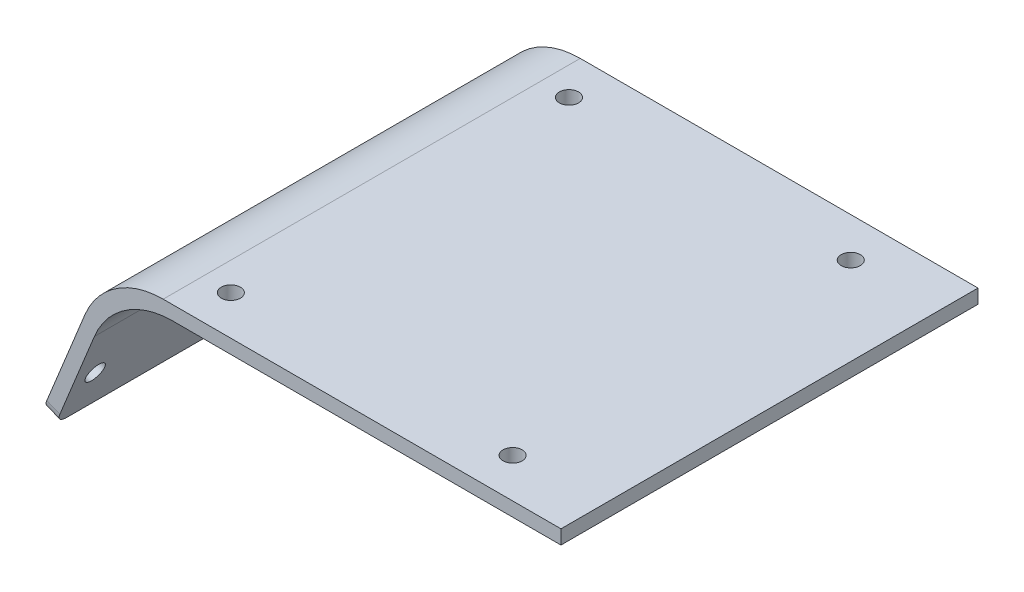
ISO-10303-21;
HEADER;
FILE_DESCRIPTION(('STEP AP214'),'2;1');
FILE_NAME('part.step','',(''),(''),'','','');
FILE_SCHEMA(('AUTOMOTIVE_DESIGN { 1 0 10303 214 1 1 1 1 }'));
ENDSEC;
DATA;
#1=APPLICATION_CONTEXT('core data for automotive mechanical design processes');
#2=APPLICATION_PROTOCOL_DEFINITION('international standard','automotive_design',2000,#1);
#3=PRODUCT_CONTEXT('',#1,'mechanical');
#4=PRODUCT('Part','Part','',(#3));
#5=PRODUCT_RELATED_PRODUCT_CATEGORY('part','',(#4));
#6=PRODUCT_DEFINITION_FORMATION('','',#4);
#7=PRODUCT_DEFINITION_CONTEXT('part definition',#1,'design');
#8=PRODUCT_DEFINITION('design','',#6,#7);
#9=PRODUCT_DEFINITION_SHAPE('','',#8);
#10=(LENGTH_UNIT() NAMED_UNIT(*) SI_UNIT(.MILLI.,.METRE.));
#11=(NAMED_UNIT(*) PLANE_ANGLE_UNIT() SI_UNIT($,.RADIAN.));
#12=(NAMED_UNIT(*) SI_UNIT($,.STERADIAN.) SOLID_ANGLE_UNIT());
#13=UNCERTAINTY_MEASURE_WITH_UNIT(LENGTH_MEASURE(1.E-05),#10,'distance_accuracy_value','');
#14=(GEOMETRIC_REPRESENTATION_CONTEXT(3) GLOBAL_UNCERTAINTY_ASSIGNED_CONTEXT((#13)) GLOBAL_UNIT_ASSIGNED_CONTEXT((#10,
#11,#12)) REPRESENTATION_CONTEXT('',''));
#15=CARTESIAN_POINT('',(0.,0.,0.));
#16=DIRECTION('',(0.,0.,1.));
#17=DIRECTION('',(1.,0.,0.));
#18=AXIS2_PLACEMENT_3D('',#15,#16,#17);
#19=CARTESIAN_POINT('',(-71.3303467015639,13.1067528996389,74.));
#20=DIRECTION('',(0.377678223385462,0.92593690907124,0.));
#21=DIRECTION('',(-0.92593690907124,0.377678223385462,0.));
#22=AXIS2_PLACEMENT_3D('',#19,#20,#21);
#23=PLANE('',#22);
#24=DIRECTION('',(0.,0.,-1.));
#25=VECTOR('',#24,1.);
#26=CARTESIAN_POINT('',(-71.3303467015639,13.1067528996389,74.));
#27=LINE('',#26,#25);
#28=CARTESIAN_POINT('',(-71.3303467015639,13.1067528996389,72.));
#29=VERTEX_POINT('',#28);
#30=CARTESIAN_POINT('',(-71.3303467015639,13.1067528996389,2.));
#31=VERTEX_POINT('',#30);
#32=EDGE_CURVE('E150',#29,#31,#27,.T.);
#33=ORIENTED_EDGE('',*,*,#32,.T.);
#34=DIRECTION('',(0.92593690907124,-0.377678223385462,0.));
#35=VECTOR('',#34,1.);
#36=CARTESIAN_POINT('',(-71.3303467015639,13.1067528996389,2.));
#37=LINE('',#36,#35);
#38=CARTESIAN_POINT('',(-69.0155044288857,12.1625573411753,2.));
#39=VERTEX_POINT('',#38);
#40=EDGE_CURVE('E187',#31,#39,#37,.T.);
#41=ORIENTED_EDGE('',*,*,#40,.T.);
#42=DIRECTION('',(0.,0.,-1.));
#43=VECTOR('',#42,1.);
#44=CARTESIAN_POINT('',(-69.0155044288857,12.1625573411753,74.));
#45=LINE('',#44,#43);
#46=CARTESIAN_POINT('',(-69.0155044288857,12.1625573411753,72.));
#47=VERTEX_POINT('',#46);
#48=EDGE_CURVE('E137',#47,#39,#45,.T.);
#49=ORIENTED_EDGE('',*,*,#48,.F.);
#50=DIRECTION('',(0.92593690907124,-0.377678223385462,0.));
#51=VECTOR('',#50,1.);
#52=CARTESIAN_POINT('',(-71.3303467015639,13.1067528996389,72.));
#53=LINE('',#52,#51);
#54=EDGE_CURVE('E185',#47,#29,#53,.F.);
#55=ORIENTED_EDGE('',*,*,#54,.T.);
#56=EDGE_LOOP('',(#33,#41,#49,#55));
#57=FACE_BOUND('',#56,.T.);
#58=ADVANCED_FACE('F34',(#57),#23,.F.);
#59=CARTESIAN_POINT('',(-69.0155044288857,12.1625573411753,74.));
#60=DIRECTION('',(-0.92593690907124,0.377678223385462,0.));
#61=DIRECTION('',(-0.377678223385462,-0.92593690907124,0.));
#62=AXIS2_PLACEMENT_3D('',#59,#60,#61);
#63=PLANE('',#62);
#64=CARTESIAN_POINT('',(-65.994078641802,19.5700526137452,4.));
#65=DIRECTION('',(-0.92593690907124,0.377678223385462,0.));
#66=DIRECTION('',(-0.377678223385462,-0.92593690907124,0.));
#67=AXIS2_PLACEMENT_3D('',#64,#65,#66);
#68=CIRCLE('',#67,1.7);
#69=CARTESIAN_POINT('',(-66.6361316215573,17.9959598683241,4.));
#70=VERTEX_POINT('',#69);
#71=EDGE_CURVE('E212',#70,#70,#68,.T.);
#72=ORIENTED_EDGE('',*,*,#71,.T.);
#73=EDGE_LOOP('',(#72));
#74=FACE_BOUND('',#73,.T.);
#75=CARTESIAN_POINT('',(-65.994078641802,19.5700526137452,70.));
#76=DIRECTION('',(-0.92593690907124,0.377678223385462,0.));
#77=DIRECTION('',(-0.377678223385462,-0.92593690907124,0.));
#78=AXIS2_PLACEMENT_3D('',#75,#76,#77);
#79=CIRCLE('',#78,1.7);
#80=CARTESIAN_POINT('',(-66.6361316215573,17.9959598683241,70.));
#81=VERTEX_POINT('',#80);
#82=EDGE_CURVE('E202',#81,#81,#79,.T.);
#83=ORIENTED_EDGE('',*,*,#82,.T.);
#84=EDGE_LOOP('',(#83));
#85=FACE_BOUND('',#84,.T.);
#86=CARTESIAN_POINT('',(-65.994078641802,19.5700526137452,35.));
#87=DIRECTION('',(-0.92593690907124,0.377678223385462,0.));
#88=DIRECTION('',(-0.377678223385462,-0.92593690907124,0.));
#89=AXIS2_PLACEMENT_3D('',#86,#87,#88);
#90=CIRCLE('',#89,1.7);
#91=CARTESIAN_POINT('',(-66.6361316215573,17.9959598683241,35.));
#92=VERTEX_POINT('',#91);
#93=EDGE_CURVE('E199',#92,#92,#90,.T.);
#94=ORIENTED_EDGE('',*,*,#93,.T.);
#95=EDGE_LOOP('',(#94));
#96=FACE_BOUND('',#95,.T.);
#97=ORIENTED_EDGE('',*,*,#48,.T.);
#98=CARTESIAN_POINT('',(-68.2601479821148,14.0144311593177,2.));
#99=DIRECTION('',(-0.92593690907124,0.377678223385462,0.));
#100=DIRECTION('',(-0.377678223385462,-0.92593690907124,0.));
#101=AXIS2_PLACEMENT_3D('',#98,#99,#100);
#102=CIRCLE('',#101,2.);
#103=CARTESIAN_POINT('',(-68.2601479821148,14.0144311593177,0.));
#104=VERTEX_POINT('',#103);
#105=EDGE_CURVE('E192',#39,#104,#102,.F.);
#106=ORIENTED_EDGE('',*,*,#105,.T.);
#107=DIRECTION('',(0.377678223385462,0.92593690907124,0.));
#108=VECTOR('',#107,1.);
#109=CARTESIAN_POINT('',(-69.0155044288857,12.1625573411753,0.));
#110=LINE('',#109,#108);
#111=CARTESIAN_POINT('',(-62.1273115734498,29.050033522558,0.));
#112=VERTEX_POINT('',#111);
#113=EDGE_CURVE('E151',#104,#112,#110,.T.);
#114=ORIENTED_EDGE('',*,*,#113,.T.);
#115=DIRECTION('',(0.,0.,-1.));
#116=VECTOR('',#115,1.);
#117=CARTESIAN_POINT('',(-62.1273115734498,29.050033522558,74.));
#118=LINE('',#117,#116);
#119=CARTESIAN_POINT('',(-62.1273115734498,29.050033522558,74.));
#120=VERTEX_POINT('',#119);
#121=EDGE_CURVE('E169',#112,#120,#118,.F.);
#122=ORIENTED_EDGE('',*,*,#121,.T.);
#123=DIRECTION('',(0.377678223385462,0.92593690907124,0.));
#124=VECTOR('',#123,1.);
#125=CARTESIAN_POINT('',(-69.0155044288857,12.1625573411753,74.));
#126=LINE('',#125,#124);
#127=CARTESIAN_POINT('',(-68.2601479821148,14.0144311593177,74.));
#128=VERTEX_POINT('',#127);
#129=EDGE_CURVE('E128',#128,#120,#126,.T.);
#130=ORIENTED_EDGE('',*,*,#129,.F.);
#131=CARTESIAN_POINT('',(-68.2601479821148,14.0144311593177,72.));
#132=DIRECTION('',(-0.92593690907124,0.377678223385462,0.));
#133=DIRECTION('',(-0.377678223385462,-0.92593690907124,0.));
#134=AXIS2_PLACEMENT_3D('',#131,#132,#133);
#135=CIRCLE('',#134,2.);
#136=EDGE_CURVE('E190',#128,#47,#135,.F.);
#137=ORIENTED_EDGE('',*,*,#136,.T.);
#138=EDGE_LOOP('',(#97,#106,#114,#122,#130,#137));
#139=FACE_BOUND('',#138,.T.);
#140=ADVANCED_FACE('F241',(#74,#85,#96,#139),#63,.F.);
#141=CARTESIAN_POINT('',(-58.3197511339116,38.3848601717761,74.));
#142=DIRECTION('',(0.,1.,0.));
#143=DIRECTION('',(-1.,0.,0.));
#144=AXIS2_PLACEMENT_3D('',#141,#142,#143);
#145=PLANE('',#144);
#146=CARTESIAN_POINT('',(-44.9185068034696,38.3848601717761,67.));
#147=DIRECTION('',(0.,1.,0.));
#148=DIRECTION('',(-1.,0.,0.));
#149=AXIS2_PLACEMENT_3D('',#146,#147,#148);
#150=CIRCLE('',#149,1.70000000000001);
#151=CARTESIAN_POINT('',(-46.6185068034696,38.3848601717761,67.));
#152=VERTEX_POINT('',#151);
#153=EDGE_CURVE('E153',#152,#152,#150,.T.);
#154=ORIENTED_EDGE('',*,*,#153,.T.);
#155=EDGE_LOOP('',(#154));
#156=FACE_BOUND('',#155,.T.);
#157=CARTESIAN_POINT('',(5.08149319653038,38.3848601717761,6.99999999999993));
#158=DIRECTION('',(0.,1.,0.));
#159=DIRECTION('',(-1.,0.,0.));
#160=AXIS2_PLACEMENT_3D('',#157,#158,#159);
#161=CIRCLE('',#160,1.7);
#162=CARTESIAN_POINT('',(3.38149319653038,38.3848601717761,6.99999999999993));
#163=VERTEX_POINT('',#162);
#164=EDGE_CURVE('E233',#163,#163,#161,.T.);
#165=ORIENTED_EDGE('',*,*,#164,.T.);
#166=EDGE_LOOP('',(#165));
#167=FACE_BOUND('',#166,.T.);
#168=CARTESIAN_POINT('',(-44.9185068034696,38.3848601717761,6.99999999999993));
#169=DIRECTION('',(0.,1.,0.));
#170=DIRECTION('',(-1.,0.,0.));
#171=AXIS2_PLACEMENT_3D('',#168,#169,#170);
#172=CIRCLE('',#171,1.69999999999999);
#173=CARTESIAN_POINT('',(-46.6185068034696,38.3848601717761,6.99999999999993));
#174=VERTEX_POINT('',#173);
#175=EDGE_CURVE('E230',#174,#174,#172,.T.);
#176=ORIENTED_EDGE('',*,*,#175,.T.);
#177=EDGE_LOOP('',(#176));
#178=FACE_BOUND('',#177,.T.);
#179=CARTESIAN_POINT('',(5.08149319653038,38.3848601717761,66.9999999999999));
#180=DIRECTION('',(0.,1.,0.));
#181=DIRECTION('',(-1.,0.,0.));
#182=AXIS2_PLACEMENT_3D('',#179,#180,#181);
#183=CIRCLE('',#182,1.70000000000001);
#184=CARTESIAN_POINT('',(3.38149319653037,38.3848601717761,66.9999999999999));
#185=VERTEX_POINT('',#184);
#186=EDGE_CURVE('E227',#185,#185,#183,.T.);
#187=ORIENTED_EDGE('',*,*,#186,.T.);
#188=EDGE_LOOP('',(#187));
#189=FACE_BOUND('',#188,.T.);
#190=DIRECTION('',(1.,0.,0.));
#191=VECTOR('',#190,1.);
#192=CARTESIAN_POINT('',(-58.3197511339116,38.3848601717761,74.));
#193=LINE('',#192,#191);
#194=CARTESIAN_POINT('',(-48.2382579373812,38.3848601717761,74.));
#195=VERTEX_POINT('',#194);
#196=CARTESIAN_POINT('',(20.66,38.3848601717761,74.));
#197=VERTEX_POINT('',#196);
#198=EDGE_CURVE('E116',#195,#197,#193,.T.);
#199=ORIENTED_EDGE('',*,*,#198,.F.);
#200=DIRECTION('',(0.,0.,-1.));
#201=VECTOR('',#200,1.);
#202=CARTESIAN_POINT('',(-48.2382579373812,38.3848601717761,0.));
#203=LINE('',#202,#201);
#204=CARTESIAN_POINT('',(-48.2382579373812,38.3848601717761,0.));
#205=VERTEX_POINT('',#204);
#206=EDGE_CURVE('E167',#195,#205,#203,.T.);
#207=ORIENTED_EDGE('',*,*,#206,.T.);
#208=DIRECTION('',(1.,0.,0.));
#209=VECTOR('',#208,1.);
#210=CARTESIAN_POINT('',(-58.3197511339116,38.3848601717761,0.));
#211=LINE('',#210,#209);
#212=CARTESIAN_POINT('',(20.66,38.3848601717761,0.));
#213=VERTEX_POINT('',#212);
#214=EDGE_CURVE('E134',#205,#213,#211,.T.);
#215=ORIENTED_EDGE('',*,*,#214,.T.);
#216=DIRECTION('',(0.,0.,-1.));
#217=VECTOR('',#216,1.);
#218=CARTESIAN_POINT('',(20.66,38.3848601717761,74.));
#219=LINE('',#218,#217);
#220=EDGE_CURVE('E131',#197,#213,#219,.T.);
#221=ORIENTED_EDGE('',*,*,#220,.F.);
#222=EDGE_LOOP('',(#199,#207,#215,#221));
#223=FACE_BOUND('',#222,.T.);
#224=ADVANCED_FACE('F132',(#156,#167,#178,#189,#223),#145,.F.);
#225=CARTESIAN_POINT('',(20.66,38.3848601717761,74.));
#226=DIRECTION('',(-1.,0.,0.));
#227=DIRECTION('',(0.,-1.,0.));
#228=AXIS2_PLACEMENT_3D('',#225,#226,#227);
#229=PLANE('',#228);
#230=DIRECTION('',(0.,1.,0.));
#231=VECTOR('',#230,1.);
#232=CARTESIAN_POINT('',(20.66,38.3848601717761,0.));
#233=LINE('',#232,#231);
#234=CARTESIAN_POINT('',(20.66,40.8848601717761,0.));
#235=VERTEX_POINT('',#234);
#236=EDGE_CURVE('E155',#213,#235,#233,.T.);
#237=ORIENTED_EDGE('',*,*,#236,.T.);
#238=DIRECTION('',(0.,0.,-1.));
#239=VECTOR('',#238,1.);
#240=CARTESIAN_POINT('',(20.66,40.8848601717761,74.));
#241=LINE('',#240,#239);
#242=CARTESIAN_POINT('',(20.66,40.8848601717761,74.));
#243=VERTEX_POINT('',#242);
#244=EDGE_CURVE('E138',#243,#235,#241,.T.);
#245=ORIENTED_EDGE('',*,*,#244,.F.);
#246=DIRECTION('',(0.,1.,0.));
#247=VECTOR('',#246,1.);
#248=CARTESIAN_POINT('',(20.66,38.3848601717761,74.));
#249=LINE('',#248,#247);
#250=EDGE_CURVE('E121',#197,#243,#249,.T.);
#251=ORIENTED_EDGE('',*,*,#250,.F.);
#252=ORIENTED_EDGE('',*,*,#220,.T.);
#253=EDGE_LOOP('',(#237,#245,#251,#252));
#254=FACE_BOUND('',#253,.T.);
#255=ADVANCED_FACE('F140',(#254),#229,.F.);
#256=CARTESIAN_POINT('',(-60.,40.8848601717761,74.));
#257=DIRECTION('',(0.,-1.,0.));
#258=DIRECTION('',(1.,0.,0.));
#259=AXIS2_PLACEMENT_3D('',#256,#257,#258);
#260=PLANE('',#259);
#261=CARTESIAN_POINT('',(-44.9185068034696,40.8848601717761,67.));
#262=DIRECTION('',(0.,1.,0.));
#263=DIRECTION('',(0.,0.,1.));
#264=AXIS2_PLACEMENT_3D('',#261,#262,#263);
#265=CIRCLE('',#264,1.70000000000001);
#266=CARTESIAN_POINT('',(-44.9185068034696,40.8848601717761,68.7));
#267=VERTEX_POINT('',#266);
#268=EDGE_CURVE('E219',#267,#267,#265,.T.);
#269=ORIENTED_EDGE('',*,*,#268,.F.);
#270=EDGE_LOOP('',(#269));
#271=FACE_BOUND('',#270,.T.);
#272=CARTESIAN_POINT('',(5.08149319653038,40.8848601717761,6.99999999999993));
#273=DIRECTION('',(0.,1.,0.));
#274=DIRECTION('',(0.,0.,1.));
#275=AXIS2_PLACEMENT_3D('',#272,#273,#274);
#276=CIRCLE('',#275,1.7);
#277=CARTESIAN_POINT('',(5.08149319653038,40.8848601717761,8.69999999999992));
#278=VERTEX_POINT('',#277);
#279=EDGE_CURVE('E218',#278,#278,#276,.T.);
#280=ORIENTED_EDGE('',*,*,#279,.F.);
#281=EDGE_LOOP('',(#280));
#282=FACE_BOUND('',#281,.T.);
#283=CARTESIAN_POINT('',(-44.9185068034696,40.8848601717761,6.99999999999993));
#284=DIRECTION('',(0.,1.,0.));
#285=DIRECTION('',(0.,0.,1.));
#286=AXIS2_PLACEMENT_3D('',#283,#284,#285);
#287=CIRCLE('',#286,1.69999999999999);
#288=CARTESIAN_POINT('',(-44.9185068034696,40.8848601717761,8.69999999999992));
#289=VERTEX_POINT('',#288);
#290=EDGE_CURVE('E215',#289,#289,#287,.T.);
#291=ORIENTED_EDGE('',*,*,#290,.F.);
#292=EDGE_LOOP('',(#291));
#293=FACE_BOUND('',#292,.T.);
#294=CARTESIAN_POINT('',(5.08149319653038,40.8848601717761,66.9999999999999));
#295=DIRECTION('',(0.,1.,0.));
#296=DIRECTION('',(0.,0.,1.));
#297=AXIS2_PLACEMENT_3D('',#294,#295,#296);
#298=CIRCLE('',#297,1.70000000000001);
#299=CARTESIAN_POINT('',(5.08149319653038,40.8848601717761,68.6999999999999));
#300=VERTEX_POINT('',#299);
#301=EDGE_CURVE('E222',#300,#300,#298,.T.);
#302=ORIENTED_EDGE('',*,*,#301,.F.);
#303=EDGE_LOOP('',(#302));
#304=FACE_BOUND('',#303,.T.);
#305=DIRECTION('',(-1.,0.,0.));
#306=VECTOR('',#305,1.);
#307=CARTESIAN_POINT('',(-60.,40.8848601717761,0.));
#308=LINE('',#307,#306);
#309=CARTESIAN_POINT('',(-49.9185068034696,40.8848601717761,0.));
#310=VERTEX_POINT('',#309);
#311=EDGE_CURVE('E157',#235,#310,#308,.T.);
#312=ORIENTED_EDGE('',*,*,#311,.T.);
#313=DIRECTION('',(0.,0.,-1.));
#314=VECTOR('',#313,1.);
#315=CARTESIAN_POINT('',(-49.9185068034696,40.8848601717761,74.));
#316=LINE('',#315,#314);
#317=CARTESIAN_POINT('',(-49.9185068034696,40.8848601717761,74.));
#318=VERTEX_POINT('',#317);
#319=EDGE_CURVE('E175',#310,#318,#316,.F.);
#320=ORIENTED_EDGE('',*,*,#319,.T.);
#321=DIRECTION('',(-1.,0.,0.));
#322=VECTOR('',#321,1.);
#323=CARTESIAN_POINT('',(-60.,40.8848601717761,74.));
#324=LINE('',#323,#322);
#325=EDGE_CURVE('E143',#243,#318,#324,.T.);
#326=ORIENTED_EDGE('',*,*,#325,.F.);
#327=ORIENTED_EDGE('',*,*,#244,.T.);
#328=EDGE_LOOP('',(#312,#320,#326,#327));
#329=FACE_BOUND('',#328,.T.);
#330=ADVANCED_FACE('F247',(#271,#282,#293,#304,#329),#260,.F.);
#331=CARTESIAN_POINT('',(-71.3303467015639,13.1067528996389,74.));
#332=DIRECTION('',(0.92593690907124,-0.377678223385462,0.));
#333=DIRECTION('',(0.377678223385462,0.92593690907124,0.));
#334=AXIS2_PLACEMENT_3D('',#331,#332,#333);
#335=PLANE('',#334);
#336=CARTESIAN_POINT('',(-68.3089209144802,20.5142481722088,4.));
#337=DIRECTION('',(0.92593690907124,-0.377678223385462,0.));
#338=DIRECTION('',(0.377678223385462,0.92593690907124,0.));
#339=AXIS2_PLACEMENT_3D('',#336,#337,#338);
#340=CIRCLE('',#339,1.7);
#341=CARTESIAN_POINT('',(-67.6668679347249,22.0883409176299,4.));
#342=VERTEX_POINT('',#341);
#343=EDGE_CURVE('E38',#342,#342,#340,.T.);
#344=ORIENTED_EDGE('',*,*,#343,.T.);
#345=EDGE_LOOP('',(#344));
#346=FACE_BOUND('',#345,.T.);
#347=CARTESIAN_POINT('',(-68.3089209144802,20.5142481722088,70.));
#348=DIRECTION('',(0.92593690907124,-0.377678223385462,0.));
#349=DIRECTION('',(0.377678223385462,0.92593690907124,0.));
#350=AXIS2_PLACEMENT_3D('',#347,#348,#349);
#351=CIRCLE('',#350,1.7);
#352=CARTESIAN_POINT('',(-67.6668679347249,22.0883409176299,70.));
#353=VERTEX_POINT('',#352);
#354=EDGE_CURVE('E200',#353,#353,#351,.T.);
#355=ORIENTED_EDGE('',*,*,#354,.T.);
#356=EDGE_LOOP('',(#355));
#357=FACE_BOUND('',#356,.T.);
#358=CARTESIAN_POINT('',(-68.3089209144802,20.5142481722089,35.));
#359=DIRECTION('',(0.92593690907124,-0.377678223385462,0.));
#360=DIRECTION('',(0.377678223385462,0.92593690907124,0.));
#361=AXIS2_PLACEMENT_3D('',#358,#359,#360);
#362=CIRCLE('',#361,1.7);
#363=CARTESIAN_POINT('',(-67.6668679347249,22.08834091763,35.));
#364=VERTEX_POINT('',#363);
#365=EDGE_CURVE('E197',#364,#364,#362,.T.);
#366=ORIENTED_EDGE('',*,*,#365,.T.);
#367=EDGE_LOOP('',(#366));
#368=FACE_BOUND('',#367,.T.);
#369=DIRECTION('',(-0.377678223385462,-0.92593690907124,0.));
#370=VECTOR('',#369,1.);
#371=CARTESIAN_POINT('',(-71.3303467015639,13.1067528996389,0.));
#372=LINE('',#371,#370);
#373=CARTESIAN_POINT('',(-63.8075604395382,31.550033522558,0.));
#374=VERTEX_POINT('',#373);
#375=CARTESIAN_POINT('',(-70.5749902547929,14.9586267177814,0.));
#376=VERTEX_POINT('',#375);
#377=EDGE_CURVE('E160',#374,#376,#372,.T.);
#378=ORIENTED_EDGE('',*,*,#377,.T.);
#379=CARTESIAN_POINT('',(-70.5749902547929,14.9586267177814,2.));
#380=DIRECTION('',(0.92593690907124,-0.377678223385462,0.));
#381=DIRECTION('',(0.377678223385462,0.92593690907124,0.));
#382=AXIS2_PLACEMENT_3D('',#379,#380,#381);
#383=CIRCLE('',#382,2.);
#384=EDGE_CURVE('E43',#376,#31,#383,.F.);
#385=ORIENTED_EDGE('',*,*,#384,.T.);
#386=ORIENTED_EDGE('',*,*,#32,.F.);
#387=CARTESIAN_POINT('',(-70.5749902547929,14.9586267177814,72.));
#388=DIRECTION('',(0.92593690907124,-0.377678223385462,0.));
#389=DIRECTION('',(0.377678223385462,0.92593690907124,0.));
#390=AXIS2_PLACEMENT_3D('',#387,#388,#389);
#391=CIRCLE('',#390,2.);
#392=CARTESIAN_POINT('',(-70.5749902547929,14.9586267177814,74.));
#393=VERTEX_POINT('',#392);
#394=EDGE_CURVE('E51',#29,#393,#391,.F.);
#395=ORIENTED_EDGE('',*,*,#394,.T.);
#396=DIRECTION('',(-0.377678223385462,-0.92593690907124,0.));
#397=VECTOR('',#396,1.);
#398=CARTESIAN_POINT('',(-71.3303467015639,13.1067528996389,74.));
#399=LINE('',#398,#397);
#400=CARTESIAN_POINT('',(-63.8075604395382,31.550033522558,74.));
#401=VERTEX_POINT('',#400);
#402=EDGE_CURVE('E145',#401,#393,#399,.T.);
#403=ORIENTED_EDGE('',*,*,#402,.F.);
#404=DIRECTION('',(0.,0.,-1.));
#405=VECTOR('',#404,1.);
#406=CARTESIAN_POINT('',(-63.8075604395382,31.550033522558,74.));
#407=LINE('',#406,#405);
#408=EDGE_CURVE('E172',#401,#374,#407,.T.);
#409=ORIENTED_EDGE('',*,*,#408,.T.);
#410=EDGE_LOOP('',(#378,#385,#386,#395,#403,#409));
#411=FACE_BOUND('',#410,.T.);
#412=ADVANCED_FACE('F253',(#346,#357,#368,#411),#335,.F.);
#413=CARTESIAN_POINT('',(0.,0.,74.));
#414=DIRECTION('',(0.,0.,1.));
#415=DIRECTION('',(1.,0.,0.));
#416=AXIS2_PLACEMENT_3D('',#413,#414,#415);
#417=PLANE('',#416);
#418=ORIENTED_EDGE('',*,*,#402,.T.);
#419=DIRECTION('',(0.92593690907124,-0.377678223385462,0.));
#420=VECTOR('',#419,1.);
#421=CARTESIAN_POINT('',(-68.2601479821148,14.0144311593177,74.));
#422=LINE('',#421,#420);
#423=EDGE_CURVE('E11',#393,#128,#422,.T.);
#424=ORIENTED_EDGE('',*,*,#423,.T.);
#425=ORIENTED_EDGE('',*,*,#129,.T.);
#426=CARTESIAN_POINT('',(-48.2382579373812,23.3848601717761,74.));
#427=DIRECTION('',(0.,0.,1.));
#428=DIRECTION('',(1.,0.,0.));
#429=AXIS2_PLACEMENT_3D('',#426,#427,#428);
#430=CIRCLE('',#429,15.);
#431=EDGE_CURVE('E124',#120,#195,#430,.F.);
#432=ORIENTED_EDGE('',*,*,#431,.T.);
#433=ORIENTED_EDGE('',*,*,#198,.T.);
#434=ORIENTED_EDGE('',*,*,#250,.T.);
#435=ORIENTED_EDGE('',*,*,#325,.T.);
#436=CARTESIAN_POINT('',(-49.9185068034696,25.8848601717761,74.));
#437=DIRECTION('',(0.,0.,1.));
#438=DIRECTION('',(1.,0.,0.));
#439=AXIS2_PLACEMENT_3D('',#436,#437,#438);
#440=CIRCLE('',#439,15.);
#441=EDGE_CURVE('E183',#318,#401,#440,.T.);
#442=ORIENTED_EDGE('',*,*,#441,.T.);
#443=EDGE_LOOP('',(#418,#424,#425,#432,#433,#434,#435,#442));
#444=FACE_BOUND('',#443,.T.);
#445=ADVANCED_FACE('F118',(#444),#417,.T.);
#446=CARTESIAN_POINT('',(0.,0.,0.));
#447=DIRECTION('',(0.,0.,1.));
#448=DIRECTION('',(1.,0.,0.));
#449=AXIS2_PLACEMENT_3D('',#446,#447,#448);
#450=PLANE('',#449);
#451=ORIENTED_EDGE('',*,*,#113,.F.);
#452=DIRECTION('',(0.92593690907124,-0.377678223385462,0.));
#453=VECTOR('',#452,1.);
#454=CARTESIAN_POINT('',(-4.83575131435981,-11.8555965046617,0.));
#455=LINE('',#454,#453);
#456=EDGE_CURVE('E59',#104,#376,#455,.F.);
#457=ORIENTED_EDGE('',*,*,#456,.T.);
#458=ORIENTED_EDGE('',*,*,#377,.F.);
#459=CARTESIAN_POINT('',(-49.9185068034696,25.8848601717761,0.));
#460=DIRECTION('',(0.,0.,1.));
#461=DIRECTION('',(1.,0.,0.));
#462=AXIS2_PLACEMENT_3D('',#459,#460,#461);
#463=CIRCLE('',#462,15.);
#464=EDGE_CURVE('E181',#374,#310,#463,.F.);
#465=ORIENTED_EDGE('',*,*,#464,.T.);
#466=ORIENTED_EDGE('',*,*,#311,.F.);
#467=ORIENTED_EDGE('',*,*,#236,.F.);
#468=ORIENTED_EDGE('',*,*,#214,.F.);
#469=CARTESIAN_POINT('',(-48.2382579373812,23.3848601717761,0.));
#470=DIRECTION('',(0.,0.,1.));
#471=DIRECTION('',(1.,0.,0.));
#472=AXIS2_PLACEMENT_3D('',#469,#470,#471);
#473=CIRCLE('',#472,15.);
#474=EDGE_CURVE('E177',#205,#112,#473,.T.);
#475=ORIENTED_EDGE('',*,*,#474,.T.);
#476=EDGE_LOOP('',(#451,#457,#458,#465,#466,#467,#468,#475));
#477=FACE_BOUND('',#476,.T.);
#478=ADVANCED_FACE('F244',(#477),#450,.F.);
#479=CARTESIAN_POINT('',(-48.2382579373812,23.3848601717761,74.));
#480=DIRECTION('',(0.,0.,1.));
#481=DIRECTION('',(1.,0.,0.));
#482=AXIS2_PLACEMENT_3D('',#479,#480,#481);
#483=CYLINDRICAL_SURFACE('',#482,15.);
#484=ORIENTED_EDGE('',*,*,#431,.F.);
#485=ORIENTED_EDGE('',*,*,#121,.F.);
#486=ORIENTED_EDGE('',*,*,#474,.F.);
#487=ORIENTED_EDGE('',*,*,#206,.F.);
#488=EDGE_LOOP('',(#484,#485,#486,#487));
#489=FACE_BOUND('',#488,.T.);
#490=ADVANCED_FACE('F243',(#489),#483,.F.);
#491=CARTESIAN_POINT('',(-49.9185068034696,25.8848601717761,74.));
#492=DIRECTION('',(0.,0.,-1.));
#493=DIRECTION('',(-1.,0.,0.));
#494=AXIS2_PLACEMENT_3D('',#491,#492,#493);
#495=CYLINDRICAL_SURFACE('',#494,15.);
#496=ORIENTED_EDGE('',*,*,#441,.F.);
#497=ORIENTED_EDGE('',*,*,#319,.F.);
#498=ORIENTED_EDGE('',*,*,#464,.F.);
#499=ORIENTED_EDGE('',*,*,#408,.F.);
#500=EDGE_LOOP('',(#496,#497,#498,#499));
#501=FACE_BOUND('',#500,.T.);
#502=ADVANCED_FACE('F252',(#501),#495,.T.);
#503=CARTESIAN_POINT('',(-70.5749902547929,14.9586267177814,2.));
#504=DIRECTION('',(0.92593690907124,-0.377678223385462,0.));
#505=DIRECTION('',(0.377678223385462,0.92593690907124,0.));
#506=AXIS2_PLACEMENT_3D('',#503,#504,#505);
#507=CYLINDRICAL_SURFACE('',#506,2.);
#508=ORIENTED_EDGE('',*,*,#384,.F.);
#509=ORIENTED_EDGE('',*,*,#456,.F.);
#510=ORIENTED_EDGE('',*,*,#105,.F.);
#511=ORIENTED_EDGE('',*,*,#40,.F.);
#512=EDGE_LOOP('',(#508,#509,#510,#511));
#513=FACE_BOUND('',#512,.T.);
#514=ADVANCED_FACE('F261',(#513),#507,.T.);
#515=CARTESIAN_POINT('',(-4.83575131435981,-11.8555965046617,72.));
#516=DIRECTION('',(-0.92593690907124,0.377678223385462,0.));
#517=DIRECTION('',(-0.377678223385462,-0.92593690907124,0.));
#518=AXIS2_PLACEMENT_3D('',#515,#516,#517);
#519=CYLINDRICAL_SURFACE('',#518,2.);
#520=ORIENTED_EDGE('',*,*,#394,.F.);
#521=ORIENTED_EDGE('',*,*,#54,.F.);
#522=ORIENTED_EDGE('',*,*,#136,.F.);
#523=ORIENTED_EDGE('',*,*,#423,.F.);
#524=EDGE_LOOP('',(#520,#521,#522,#523));
#525=FACE_BOUND('',#524,.T.);
#526=ADVANCED_FACE('F36',(#525),#519,.T.);
#527=CARTESIAN_POINT('',(5.08149319653038,30.8848601717761,66.9999999999999));
#528=DIRECTION('',(0.,1.,0.));
#529=DIRECTION('',(0.,0.,1.));
#530=AXIS2_PLACEMENT_3D('',#527,#528,#529);
#531=CYLINDRICAL_SURFACE('',#530,1.70000000000001);
#532=ORIENTED_EDGE('',*,*,#301,.T.);
#533=EDGE_LOOP('',(#532));
#534=FACE_BOUND('',#533,.T.);
#535=ORIENTED_EDGE('',*,*,#186,.F.);
#536=EDGE_LOOP('',(#535));
#537=FACE_BOUND('',#536,.T.);
#538=ADVANCED_FACE('F267',(#534,#537),#531,.F.);
#539=CARTESIAN_POINT('',(-44.9185068034696,30.8848601717761,6.99999999999993));
#540=DIRECTION('',(0.,1.,0.));
#541=DIRECTION('',(0.,0.,1.));
#542=AXIS2_PLACEMENT_3D('',#539,#540,#541);
#543=CYLINDRICAL_SURFACE('',#542,1.69999999999999);
#544=ORIENTED_EDGE('',*,*,#290,.T.);
#545=EDGE_LOOP('',(#544));
#546=FACE_BOUND('',#545,.T.);
#547=ORIENTED_EDGE('',*,*,#175,.F.);
#548=EDGE_LOOP('',(#547));
#549=FACE_BOUND('',#548,.T.);
#550=ADVANCED_FACE('F309',(#546,#549),#543,.F.);
#551=CARTESIAN_POINT('',(5.08149319653038,30.8848601717761,6.99999999999993));
#552=DIRECTION('',(0.,1.,0.));
#553=DIRECTION('',(0.,0.,1.));
#554=AXIS2_PLACEMENT_3D('',#551,#552,#553);
#555=CYLINDRICAL_SURFACE('',#554,1.7);
#556=ORIENTED_EDGE('',*,*,#279,.T.);
#557=EDGE_LOOP('',(#556));
#558=FACE_BOUND('',#557,.T.);
#559=ORIENTED_EDGE('',*,*,#164,.F.);
#560=EDGE_LOOP('',(#559));
#561=FACE_BOUND('',#560,.T.);
#562=ADVANCED_FACE('F314',(#558,#561),#555,.F.);
#563=CARTESIAN_POINT('',(-44.9185068034696,30.8848601717761,67.));
#564=DIRECTION('',(0.,1.,0.));
#565=DIRECTION('',(0.,0.,1.));
#566=AXIS2_PLACEMENT_3D('',#563,#564,#565);
#567=CYLINDRICAL_SURFACE('',#566,1.70000000000001);
#568=ORIENTED_EDGE('',*,*,#268,.T.);
#569=EDGE_LOOP('',(#568));
#570=FACE_BOUND('',#569,.T.);
#571=ORIENTED_EDGE('',*,*,#153,.F.);
#572=EDGE_LOOP('',(#571));
#573=FACE_BOUND('',#572,.T.);
#574=ADVANCED_FACE('F320',(#570,#573),#567,.F.);
#575=CARTESIAN_POINT('',(10.890036470296,-11.7900278816165,35.));
#576=DIRECTION('',(-0.92593690907124,0.377678223385462,0.));
#577=DIRECTION('',(-0.377678223385462,-0.92593690907124,0.));
#578=AXIS2_PLACEMENT_3D('',#575,#576,#577);
#579=CYLINDRICAL_SURFACE('',#578,1.7);
#580=ORIENTED_EDGE('',*,*,#365,.F.);
#581=EDGE_LOOP('',(#580));
#582=FACE_BOUND('',#581,.T.);
#583=ORIENTED_EDGE('',*,*,#93,.F.);
#584=EDGE_LOOP('',(#583));
#585=FACE_BOUND('',#584,.T.);
#586=ADVANCED_FACE('F323',(#582,#585),#579,.F.);
#587=CARTESIAN_POINT('',(10.890036470296,-11.7900278816165,70.));
#588=DIRECTION('',(-0.92593690907124,0.377678223385462,0.));
#589=DIRECTION('',(-0.377678223385462,-0.92593690907124,0.));
#590=AXIS2_PLACEMENT_3D('',#587,#588,#589);
#591=CYLINDRICAL_SURFACE('',#590,1.7);
#592=ORIENTED_EDGE('',*,*,#354,.F.);
#593=EDGE_LOOP('',(#592));
#594=FACE_BOUND('',#593,.T.);
#595=ORIENTED_EDGE('',*,*,#82,.F.);
#596=EDGE_LOOP('',(#595));
#597=FACE_BOUND('',#596,.T.);
#598=ADVANCED_FACE('F328',(#594,#597),#591,.F.);
#599=CARTESIAN_POINT('',(10.890036470296,-11.7900278816166,4.));
#600=DIRECTION('',(-0.92593690907124,0.377678223385462,0.));
#601=DIRECTION('',(-0.377678223385462,-0.92593690907124,0.));
#602=AXIS2_PLACEMENT_3D('',#599,#600,#601);
#603=CYLINDRICAL_SURFACE('',#602,1.7);
#604=ORIENTED_EDGE('',*,*,#343,.F.);
#605=EDGE_LOOP('',(#604));
#606=FACE_BOUND('',#605,.T.);
#607=ORIENTED_EDGE('',*,*,#71,.F.);
#608=EDGE_LOOP('',(#607));
#609=FACE_BOUND('',#608,.T.);
#610=ADVANCED_FACE('F332',(#606,#609),#603,.F.);
#611=CLOSED_SHELL('',(#58,#140,#224,#255,#330,#412,#445,#478,#490,#502,#514,#526,#538,#550,#562,
#574,#586,#598,#610));
#612=MANIFOLD_SOLID_BREP('B2',#611);
#613=ADVANCED_BREP_SHAPE_REPRESENTATION('',(#18,#612),#14);
#614=SHAPE_DEFINITION_REPRESENTATION(#9,#613);
ENDSEC;
END-ISO-10303-21;
